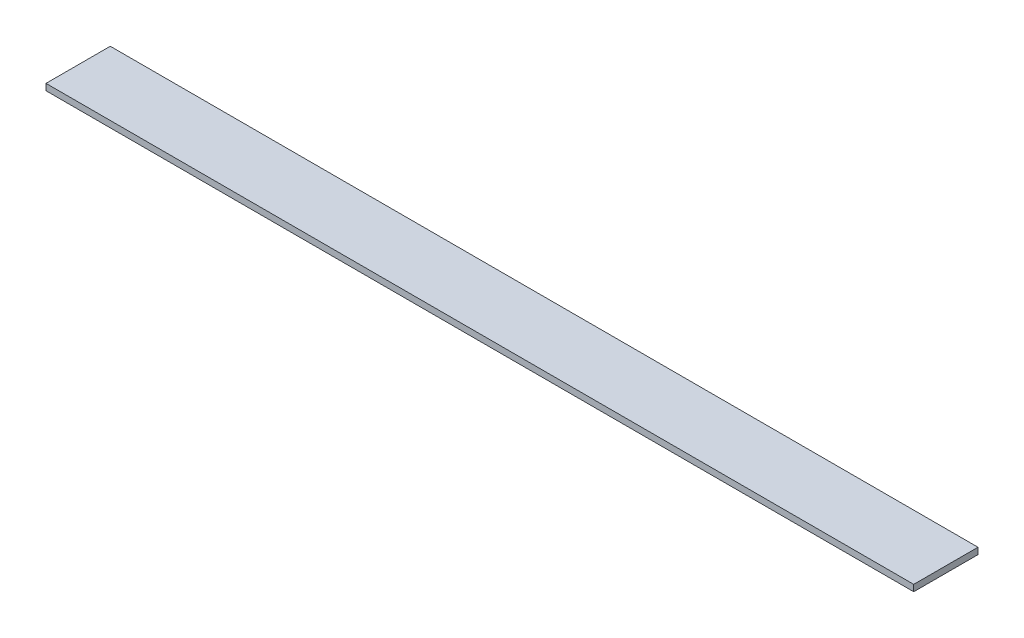
ISO-10303-21;
HEADER;
FILE_DESCRIPTION(('STEP AP214'),'2;1');
FILE_NAME('part.step','',(''),(''),'','','');
FILE_SCHEMA(('AUTOMOTIVE_DESIGN { 1 0 10303 214 1 1 1 1 }'));
ENDSEC;
DATA;
#1=APPLICATION_CONTEXT('core data for automotive mechanical design processes');
#2=APPLICATION_PROTOCOL_DEFINITION('international standard','automotive_design',2000,#1);
#3=PRODUCT_CONTEXT('',#1,'mechanical');
#4=PRODUCT('Part','Part','',(#3));
#5=PRODUCT_RELATED_PRODUCT_CATEGORY('part','',(#4));
#6=PRODUCT_DEFINITION_FORMATION('','',#4);
#7=PRODUCT_DEFINITION_CONTEXT('part definition',#1,'design');
#8=PRODUCT_DEFINITION('design','',#6,#7);
#9=PRODUCT_DEFINITION_SHAPE('','',#8);
#10=(LENGTH_UNIT() NAMED_UNIT(*) SI_UNIT(.MILLI.,.METRE.));
#11=(NAMED_UNIT(*) PLANE_ANGLE_UNIT() SI_UNIT($,.RADIAN.));
#12=(NAMED_UNIT(*) SI_UNIT($,.STERADIAN.) SOLID_ANGLE_UNIT());
#13=UNCERTAINTY_MEASURE_WITH_UNIT(LENGTH_MEASURE(1.E-05),#10,'distance_accuracy_value','');
#14=(GEOMETRIC_REPRESENTATION_CONTEXT(3) GLOBAL_UNCERTAINTY_ASSIGNED_CONTEXT((#13)) GLOBAL_UNIT_ASSIGNED_CONTEXT((#10,
#11,#12)) REPRESENTATION_CONTEXT('',''));
#15=CARTESIAN_POINT('',(0.,0.,0.));
#16=DIRECTION('',(0.,0.,1.));
#17=DIRECTION('',(1.,0.,0.));
#18=AXIS2_PLACEMENT_3D('',#15,#16,#17);
#19=CARTESIAN_POINT('',(0.,10.,0.));
#20=DIRECTION('',(1.,0.,0.));
#21=DIRECTION('',(0.,0.,-1.));
#22=AXIS2_PLACEMENT_3D('',#19,#20,#21);
#23=PLANE('',#22);
#24=DIRECTION('',(0.,0.,1.));
#25=VECTOR('',#24,1.);
#26=CARTESIAN_POINT('',(0.,0.,0.));
#27=LINE('',#26,#25);
#28=CARTESIAN_POINT('',(0.,0.,-100.));
#29=VERTEX_POINT('',#28);
#30=CARTESIAN_POINT('',(0.,0.,0.));
#31=VERTEX_POINT('',#30);
#32=EDGE_CURVE('E94',#29,#31,#27,.T.);
#33=ORIENTED_EDGE('',*,*,#32,.T.);
#34=DIRECTION('',(0.,-1.,0.));
#35=VECTOR('',#34,1.);
#36=CARTESIAN_POINT('',(0.,10.,0.));
#37=LINE('',#36,#35);
#38=CARTESIAN_POINT('',(0.,10.,0.));
#39=VERTEX_POINT('',#38);
#40=EDGE_CURVE('E11',#39,#31,#37,.T.);
#41=ORIENTED_EDGE('',*,*,#40,.F.);
#42=DIRECTION('',(0.,0.,1.));
#43=VECTOR('',#42,1.);
#44=CARTESIAN_POINT('',(0.,10.,0.));
#45=LINE('',#44,#43);
#46=CARTESIAN_POINT('',(0.,10.,-100.));
#47=VERTEX_POINT('',#46);
#48=EDGE_CURVE('E82',#47,#39,#45,.T.);
#49=ORIENTED_EDGE('',*,*,#48,.F.);
#50=DIRECTION('',(0.,-1.,0.));
#51=VECTOR('',#50,1.);
#52=CARTESIAN_POINT('',(0.,10.,-100.));
#53=LINE('',#52,#51);
#54=EDGE_CURVE('E90',#47,#29,#53,.T.);
#55=ORIENTED_EDGE('',*,*,#54,.T.);
#56=EDGE_LOOP('',(#33,#41,#49,#55));
#57=FACE_BOUND('',#56,.T.);
#58=ADVANCED_FACE('F31',(#57),#23,.F.);
#59=CARTESIAN_POINT('',(0.,10.,0.));
#60=DIRECTION('',(0.,0.,-1.));
#61=DIRECTION('',(-1.,0.,0.));
#62=AXIS2_PLACEMENT_3D('',#59,#60,#61);
#63=PLANE('',#62);
#64=DIRECTION('',(1.,0.,0.));
#65=VECTOR('',#64,1.);
#66=CARTESIAN_POINT('',(0.,0.,0.));
#67=LINE('',#66,#65);
#68=CARTESIAN_POINT('',(1350.,0.,0.));
#69=VERTEX_POINT('',#68);
#70=EDGE_CURVE('E86',#31,#69,#67,.T.);
#71=ORIENTED_EDGE('',*,*,#70,.T.);
#72=DIRECTION('',(0.,-1.,0.));
#73=VECTOR('',#72,1.);
#74=CARTESIAN_POINT('',(1350.,10.,0.));
#75=LINE('',#74,#73);
#76=CARTESIAN_POINT('',(1350.,10.,0.));
#77=VERTEX_POINT('',#76);
#78=EDGE_CURVE('E39',#77,#69,#75,.T.);
#79=ORIENTED_EDGE('',*,*,#78,.F.);
#80=DIRECTION('',(1.,0.,0.));
#81=VECTOR('',#80,1.);
#82=CARTESIAN_POINT('',(0.,10.,0.));
#83=LINE('',#82,#81);
#84=EDGE_CURVE('E77',#39,#77,#83,.T.);
#85=ORIENTED_EDGE('',*,*,#84,.F.);
#86=ORIENTED_EDGE('',*,*,#40,.T.);
#87=EDGE_LOOP('',(#71,#79,#85,#86));
#88=FACE_BOUND('',#87,.T.);
#89=ADVANCED_FACE('F85',(#88),#63,.F.);
#90=CARTESIAN_POINT('',(1350.,10.,0.));
#91=DIRECTION('',(-1.,0.,0.));
#92=DIRECTION('',(0.,0.,1.));
#93=AXIS2_PLACEMENT_3D('',#90,#91,#92);
#94=PLANE('',#93);
#95=DIRECTION('',(0.,0.,-1.));
#96=VECTOR('',#95,1.);
#97=CARTESIAN_POINT('',(1350.,0.,0.));
#98=LINE('',#97,#96);
#99=CARTESIAN_POINT('',(1350.,0.,-100.));
#100=VERTEX_POINT('',#99);
#101=EDGE_CURVE('E64',#69,#100,#98,.T.);
#102=ORIENTED_EDGE('',*,*,#101,.T.);
#103=DIRECTION('',(0.,-1.,0.));
#104=VECTOR('',#103,1.);
#105=CARTESIAN_POINT('',(1350.,10.,-100.));
#106=LINE('',#105,#104);
#107=CARTESIAN_POINT('',(1350.,10.,-100.));
#108=VERTEX_POINT('',#107);
#109=EDGE_CURVE('E87',#108,#100,#106,.T.);
#110=ORIENTED_EDGE('',*,*,#109,.F.);
#111=DIRECTION('',(0.,0.,-1.));
#112=VECTOR('',#111,1.);
#113=CARTESIAN_POINT('',(1350.,10.,0.));
#114=LINE('',#113,#112);
#115=EDGE_CURVE('E80',#77,#108,#114,.T.);
#116=ORIENTED_EDGE('',*,*,#115,.F.);
#117=ORIENTED_EDGE('',*,*,#78,.T.);
#118=EDGE_LOOP('',(#102,#110,#116,#117));
#119=FACE_BOUND('',#118,.T.);
#120=ADVANCED_FACE('F88',(#119),#94,.F.);
#121=CARTESIAN_POINT('',(0.,10.,-100.));
#122=DIRECTION('',(0.,0.,1.));
#123=DIRECTION('',(1.,0.,0.));
#124=AXIS2_PLACEMENT_3D('',#121,#122,#123);
#125=PLANE('',#124);
#126=DIRECTION('',(-1.,0.,0.));
#127=VECTOR('',#126,1.);
#128=CARTESIAN_POINT('',(0.,0.,-100.));
#129=LINE('',#128,#127);
#130=EDGE_CURVE('E70',#100,#29,#129,.T.);
#131=ORIENTED_EDGE('',*,*,#130,.T.);
#132=ORIENTED_EDGE('',*,*,#54,.F.);
#133=DIRECTION('',(-1.,0.,0.));
#134=VECTOR('',#133,1.);
#135=CARTESIAN_POINT('',(0.,10.,-100.));
#136=LINE('',#135,#134);
#137=EDGE_CURVE('E47',#108,#47,#136,.T.);
#138=ORIENTED_EDGE('',*,*,#137,.F.);
#139=ORIENTED_EDGE('',*,*,#109,.T.);
#140=EDGE_LOOP('',(#131,#132,#138,#139));
#141=FACE_BOUND('',#140,.T.);
#142=ADVANCED_FACE('F101',(#141),#125,.F.);
#143=CARTESIAN_POINT('',(0.,10.,-100.));
#144=DIRECTION('',(0.,-1.,0.));
#145=DIRECTION('',(0.,0.,-1.));
#146=AXIS2_PLACEMENT_3D('',#143,#144,#145);
#147=PLANE('',#146);
#148=ORIENTED_EDGE('',*,*,#48,.T.);
#149=ORIENTED_EDGE('',*,*,#84,.T.);
#150=ORIENTED_EDGE('',*,*,#115,.T.);
#151=ORIENTED_EDGE('',*,*,#137,.T.);
#152=EDGE_LOOP('',(#148,#149,#150,#151));
#153=FACE_BOUND('',#152,.T.);
#154=ADVANCED_FACE('F78',(#153),#147,.F.);
#155=CARTESIAN_POINT('',(0.,0.,-100.));
#156=DIRECTION('',(0.,-1.,0.));
#157=DIRECTION('',(0.,0.,-1.));
#158=AXIS2_PLACEMENT_3D('',#155,#156,#157);
#159=PLANE('',#158);
#160=ORIENTED_EDGE('',*,*,#32,.F.);
#161=ORIENTED_EDGE('',*,*,#130,.F.);
#162=ORIENTED_EDGE('',*,*,#101,.F.);
#163=ORIENTED_EDGE('',*,*,#70,.F.);
#164=EDGE_LOOP('',(#160,#161,#162,#163));
#165=FACE_BOUND('',#164,.T.);
#166=ADVANCED_FACE('F104',(#165),#159,.T.);
#167=CLOSED_SHELL('',(#58,#89,#120,#142,#154,#166));
#168=MANIFOLD_SOLID_BREP('B2',#167);
#169=ADVANCED_BREP_SHAPE_REPRESENTATION('',(#18,#168),#14);
#170=SHAPE_DEFINITION_REPRESENTATION(#9,#169);
ENDSEC;
END-ISO-10303-21;
